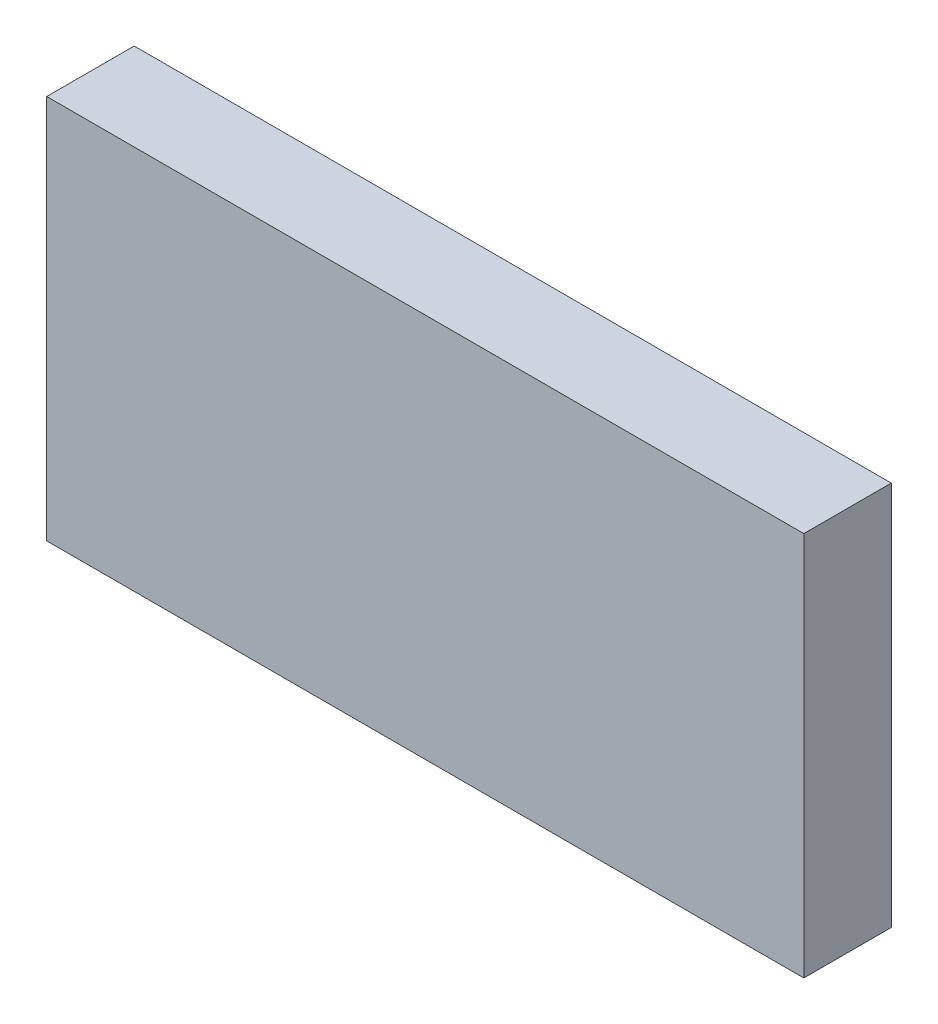
ISO-10303-21;
HEADER;
FILE_DESCRIPTION(('STEP AP214'),'2;1');
FILE_NAME('part.step','',(''),(''),'','','');
FILE_SCHEMA(('AUTOMOTIVE_DESIGN { 1 0 10303 214 1 1 1 1 }'));
ENDSEC;
DATA;
#1=APPLICATION_CONTEXT('core data for automotive mechanical design processes');
#2=APPLICATION_PROTOCOL_DEFINITION('international standard','automotive_design',2000,#1);
#3=PRODUCT_CONTEXT('',#1,'mechanical');
#4=PRODUCT('Part','Part','',(#3));
#5=PRODUCT_RELATED_PRODUCT_CATEGORY('part','',(#4));
#6=PRODUCT_DEFINITION_FORMATION('','',#4);
#7=PRODUCT_DEFINITION_CONTEXT('part definition',#1,'design');
#8=PRODUCT_DEFINITION('design','',#6,#7);
#9=PRODUCT_DEFINITION_SHAPE('','',#8);
#10=(LENGTH_UNIT() NAMED_UNIT(*) SI_UNIT(.MILLI.,.METRE.));
#11=(NAMED_UNIT(*) PLANE_ANGLE_UNIT() SI_UNIT($,.RADIAN.));
#12=(NAMED_UNIT(*) SI_UNIT($,.STERADIAN.) SOLID_ANGLE_UNIT());
#13=UNCERTAINTY_MEASURE_WITH_UNIT(LENGTH_MEASURE(1.E-05),#10,'distance_accuracy_value','');
#14=(GEOMETRIC_REPRESENTATION_CONTEXT(3) GLOBAL_UNCERTAINTY_ASSIGNED_CONTEXT((#13)) GLOBAL_UNIT_ASSIGNED_CONTEXT((#10,
#11,#12)) REPRESENTATION_CONTEXT('',''));
#15=CARTESIAN_POINT('',(0.,0.,0.));
#16=DIRECTION('',(0.,0.,1.));
#17=DIRECTION('',(1.,0.,0.));
#18=AXIS2_PLACEMENT_3D('',#15,#16,#17);
#19=CARTESIAN_POINT('',(-1.445,0.18,0.));
#20=DIRECTION('',(1.,0.,0.));
#21=DIRECTION('',(0.,0.,1.));
#22=AXIS2_PLACEMENT_3D('',#19,#20,#21);
#23=PLANE('',#22);
#24=DIRECTION('',(0.,1.,0.));
#25=VECTOR('',#24,1.);
#26=CARTESIAN_POINT('',(-1.445,0.18,0.1));
#27=LINE('',#26,#25);
#28=CARTESIAN_POINT('',(-1.445,0.18,0.1));
#29=VERTEX_POINT('',#28);
#30=CARTESIAN_POINT('',(-1.445,0.62,0.1));
#31=VERTEX_POINT('',#30);
#32=EDGE_CURVE('E11',#29,#31,#27,.T.);
#33=ORIENTED_EDGE('',*,*,#32,.T.);
#34=DIRECTION('',(0.,0.,1.));
#35=VECTOR('',#34,1.);
#36=CARTESIAN_POINT('',(-1.445,0.62,0.));
#37=LINE('',#36,#35);
#38=CARTESIAN_POINT('',(-1.445,0.62,0.));
#39=VERTEX_POINT('',#38);
#40=EDGE_CURVE('E24',#39,#31,#37,.T.);
#41=ORIENTED_EDGE('',*,*,#40,.F.);
#42=DIRECTION('',(0.,1.,0.));
#43=VECTOR('',#42,1.);
#44=CARTESIAN_POINT('',(-1.445,0.18,0.));
#45=LINE('',#44,#43);
#46=CARTESIAN_POINT('',(-1.445,0.18,0.));
#47=VERTEX_POINT('',#46);
#48=EDGE_CURVE('E86',#47,#39,#45,.T.);
#49=ORIENTED_EDGE('',*,*,#48,.F.);
#50=DIRECTION('',(0.,0.,1.));
#51=VECTOR('',#50,1.);
#52=CARTESIAN_POINT('',(-1.445,0.18,0.));
#53=LINE('',#52,#51);
#54=EDGE_CURVE('E36',#47,#29,#53,.T.);
#55=ORIENTED_EDGE('',*,*,#54,.T.);
#56=EDGE_LOOP('',(#33,#41,#49,#55));
#57=FACE_BOUND('',#56,.T.);
#58=ADVANCED_FACE('F17',(#57),#23,.F.);
#59=CARTESIAN_POINT('',(-0.5795,0.18,0.));
#60=DIRECTION('',(1.,0.,0.));
#61=DIRECTION('',(0.,0.,1.));
#62=AXIS2_PLACEMENT_3D('',#59,#60,#61);
#63=PLANE('',#62);
#64=DIRECTION('',(0.,0.,1.));
#65=VECTOR('',#64,1.);
#66=CARTESIAN_POINT('',(-0.5795,0.18,0.));
#67=LINE('',#66,#65);
#68=CARTESIAN_POINT('',(-0.5795,0.18,0.));
#69=VERTEX_POINT('',#68);
#70=CARTESIAN_POINT('',(-0.5795,0.18,0.1));
#71=VERTEX_POINT('',#70);
#72=EDGE_CURVE('E83',#69,#71,#67,.T.);
#73=ORIENTED_EDGE('',*,*,#72,.F.);
#74=DIRECTION('',(0.,1.,0.));
#75=VECTOR('',#74,1.);
#76=CARTESIAN_POINT('',(-0.5795,0.18,0.));
#77=LINE('',#76,#75);
#78=CARTESIAN_POINT('',(-0.5795,0.62,0.));
#79=VERTEX_POINT('',#78);
#80=EDGE_CURVE('E63',#69,#79,#77,.T.);
#81=ORIENTED_EDGE('',*,*,#80,.T.);
#82=DIRECTION('',(0.,0.,1.));
#83=VECTOR('',#82,1.);
#84=CARTESIAN_POINT('',(-0.5795,0.62,0.));
#85=LINE('',#84,#83);
#86=CARTESIAN_POINT('',(-0.5795,0.62,0.1));
#87=VERTEX_POINT('',#86);
#88=EDGE_CURVE('E57',#79,#87,#85,.T.);
#89=ORIENTED_EDGE('',*,*,#88,.T.);
#90=DIRECTION('',(0.,1.,0.));
#91=VECTOR('',#90,1.);
#92=CARTESIAN_POINT('',(-0.5795,0.18,0.1));
#93=LINE('',#92,#91);
#94=EDGE_CURVE('E60',#71,#87,#93,.T.);
#95=ORIENTED_EDGE('',*,*,#94,.F.);
#96=EDGE_LOOP('',(#73,#81,#89,#95));
#97=FACE_BOUND('',#96,.T.);
#98=ADVANCED_FACE('F59',(#97),#63,.T.);
#99=CARTESIAN_POINT('',(-1.445,0.18,0.));
#100=DIRECTION('',(0.,1.,0.));
#101=DIRECTION('',(0.,0.,1.));
#102=AXIS2_PLACEMENT_3D('',#99,#100,#101);
#103=PLANE('',#102);
#104=ORIENTED_EDGE('',*,*,#72,.T.);
#105=DIRECTION('',(1.,0.,0.));
#106=VECTOR('',#105,1.);
#107=CARTESIAN_POINT('',(-1.445,0.18,0.1));
#108=LINE('',#107,#106);
#109=EDGE_CURVE('E71',#29,#71,#108,.T.);
#110=ORIENTED_EDGE('',*,*,#109,.F.);
#111=ORIENTED_EDGE('',*,*,#54,.F.);
#112=DIRECTION('',(1.,0.,0.));
#113=VECTOR('',#112,1.);
#114=CARTESIAN_POINT('',(-1.445,0.18,0.));
#115=LINE('',#114,#113);
#116=EDGE_CURVE('E76',#47,#69,#115,.T.);
#117=ORIENTED_EDGE('',*,*,#116,.T.);
#118=EDGE_LOOP('',(#104,#110,#111,#117));
#119=FACE_BOUND('',#118,.T.);
#120=ADVANCED_FACE('F91',(#119),#103,.F.);
#121=CARTESIAN_POINT('',(-1.445,0.62,0.));
#122=DIRECTION('',(0.,1.,0.));
#123=DIRECTION('',(0.,0.,1.));
#124=AXIS2_PLACEMENT_3D('',#121,#122,#123);
#125=PLANE('',#124);
#126=DIRECTION('',(1.,0.,0.));
#127=VECTOR('',#126,1.);
#128=CARTESIAN_POINT('',(-1.445,0.62,0.));
#129=LINE('',#128,#127);
#130=EDGE_CURVE('E74',#39,#79,#129,.T.);
#131=ORIENTED_EDGE('',*,*,#130,.F.);
#132=ORIENTED_EDGE('',*,*,#40,.T.);
#133=DIRECTION('',(1.,0.,0.));
#134=VECTOR('',#133,1.);
#135=CARTESIAN_POINT('',(-1.445,0.62,0.1));
#136=LINE('',#135,#134);
#137=EDGE_CURVE('E69',#31,#87,#136,.T.);
#138=ORIENTED_EDGE('',*,*,#137,.T.);
#139=ORIENTED_EDGE('',*,*,#88,.F.);
#140=EDGE_LOOP('',(#131,#132,#138,#139));
#141=FACE_BOUND('',#140,.T.);
#142=ADVANCED_FACE('F73',(#141),#125,.T.);
#143=CARTESIAN_POINT('',(-1.445,0.18,0.));
#144=DIRECTION('',(0.,0.,1.));
#145=DIRECTION('',(1.,0.,0.));
#146=AXIS2_PLACEMENT_3D('',#143,#144,#145);
#147=PLANE('',#146);
#148=ORIENTED_EDGE('',*,*,#130,.T.);
#149=ORIENTED_EDGE('',*,*,#80,.F.);
#150=ORIENTED_EDGE('',*,*,#116,.F.);
#151=ORIENTED_EDGE('',*,*,#48,.T.);
#152=EDGE_LOOP('',(#148,#149,#150,#151));
#153=FACE_BOUND('',#152,.T.);
#154=ADVANCED_FACE('F89',(#153),#147,.F.);
#155=CARTESIAN_POINT('',(-1.445,0.18,0.1));
#156=DIRECTION('',(0.,0.,1.));
#157=DIRECTION('',(1.,0.,0.));
#158=AXIS2_PLACEMENT_3D('',#155,#156,#157);
#159=PLANE('',#158);
#160=ORIENTED_EDGE('',*,*,#32,.F.);
#161=ORIENTED_EDGE('',*,*,#109,.T.);
#162=ORIENTED_EDGE('',*,*,#94,.T.);
#163=ORIENTED_EDGE('',*,*,#137,.F.);
#164=EDGE_LOOP('',(#160,#161,#162,#163));
#165=FACE_BOUND('',#164,.T.);
#166=ADVANCED_FACE('F68',(#165),#159,.T.);
#167=CLOSED_SHELL('',(#58,#98,#120,#142,#154,#166));
#168=MANIFOLD_SOLID_BREP('B1',#167);
#169=ADVANCED_BREP_SHAPE_REPRESENTATION('',(#18,#168),#14);
#170=SHAPE_DEFINITION_REPRESENTATION(#9,#169);
ENDSEC;
END-ISO-10303-21;
